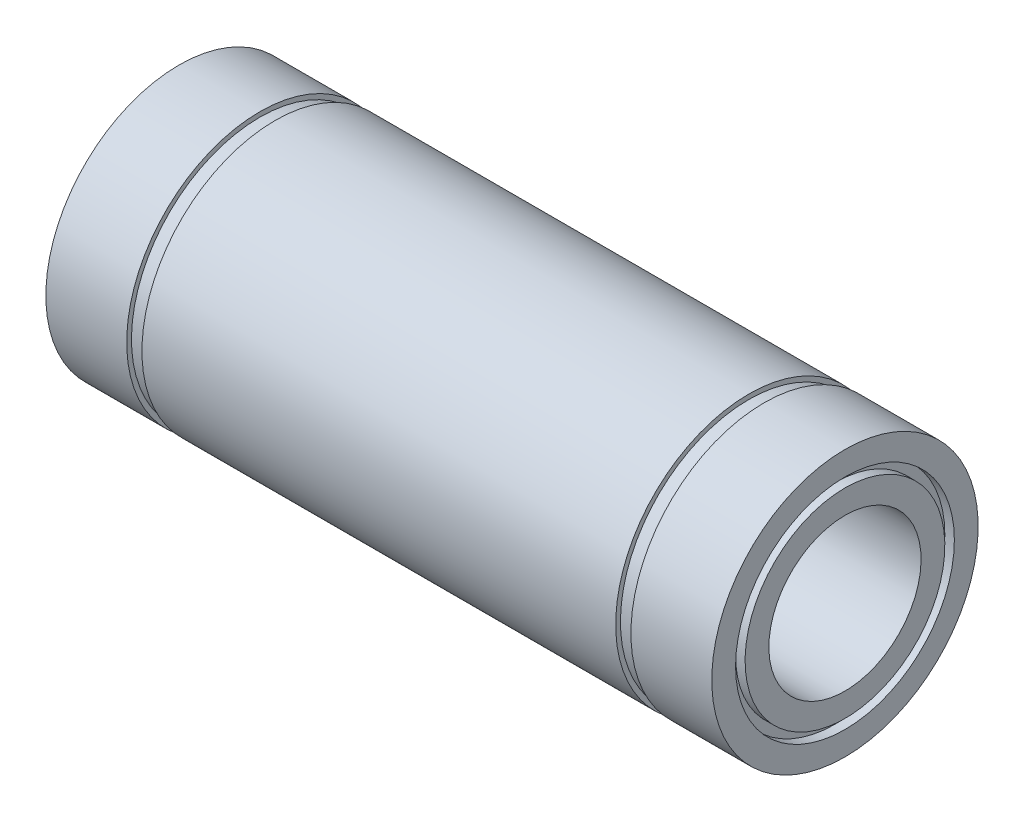
ISO-10303-21;
HEADER;
FILE_DESCRIPTION(('STEP AP214'),'2;1');
FILE_NAME('part.step','',(''),(''),'','','');
FILE_SCHEMA(('AUTOMOTIVE_DESIGN { 1 0 10303 214 1 1 1 1 }'));
ENDSEC;
DATA;
#1=APPLICATION_CONTEXT('core data for automotive mechanical design processes');
#2=APPLICATION_PROTOCOL_DEFINITION('international standard','automotive_design',2000,#1);
#3=PRODUCT_CONTEXT('',#1,'mechanical');
#4=PRODUCT('Part','Part','',(#3));
#5=PRODUCT_RELATED_PRODUCT_CATEGORY('part','',(#4));
#6=PRODUCT_DEFINITION_FORMATION('','',#4);
#7=PRODUCT_DEFINITION_CONTEXT('part definition',#1,'design');
#8=PRODUCT_DEFINITION('design','',#6,#7);
#9=PRODUCT_DEFINITION_SHAPE('','',#8);
#10=(LENGTH_UNIT() NAMED_UNIT(*) SI_UNIT(.MILLI.,.METRE.));
#11=(NAMED_UNIT(*) PLANE_ANGLE_UNIT() SI_UNIT($,.RADIAN.));
#12=(NAMED_UNIT(*) SI_UNIT($,.STERADIAN.) SOLID_ANGLE_UNIT());
#13=UNCERTAINTY_MEASURE_WITH_UNIT(LENGTH_MEASURE(1.E-05),#10,'distance_accuracy_value','');
#14=(GEOMETRIC_REPRESENTATION_CONTEXT(3) GLOBAL_UNCERTAINTY_ASSIGNED_CONTEXT((#13)) GLOBAL_UNIT_ASSIGNED_CONTEXT((#10,
#11,#12)) REPRESENTATION_CONTEXT('',''));
#15=CARTESIAN_POINT('',(0.,0.,0.));
#16=DIRECTION('',(0.,0.,1.));
#17=DIRECTION('',(1.,0.,0.));
#18=AXIS2_PLACEMENT_3D('',#15,#16,#17);
#19=CARTESIAN_POINT('',(-35.,11.5,0.));
#20=DIRECTION('',(-1.,0.,0.));
#21=DIRECTION('',(0.,-1.,0.));
#22=AXIS2_PLACEMENT_3D('',#19,#20,#21);
#23=PLANE('',#22);
#24=CARTESIAN_POINT('',(-35.,0.,0.));
#25=DIRECTION('',(1.,0.,0.));
#26=DIRECTION('',(0.,1.,0.));
#27=AXIS2_PLACEMENT_3D('',#24,#25,#26);
#28=CIRCLE('',#27,11.5);
#29=CARTESIAN_POINT('',(-35.,11.5,0.));
#30=VERTEX_POINT('',#29);
#31=EDGE_CURVE('E123',#30,#30,#28,.T.);
#32=ORIENTED_EDGE('',*,*,#31,.T.);
#33=EDGE_LOOP('',(#32));
#34=FACE_BOUND('',#33,.T.);
#35=CARTESIAN_POINT('',(-35.,0.,0.));
#36=DIRECTION('',(1.,0.,0.));
#37=DIRECTION('',(0.,1.,0.));
#38=AXIS2_PLACEMENT_3D('',#35,#36,#37);
#39=CIRCLE('',#38,14.);
#40=CARTESIAN_POINT('',(-35.,14.,0.));
#41=VERTEX_POINT('',#40);
#42=EDGE_CURVE('E10',#41,#41,#39,.T.);
#43=ORIENTED_EDGE('',*,*,#42,.F.);
#44=EDGE_LOOP('',(#43));
#45=FACE_BOUND('',#44,.T.);
#46=ADVANCED_FACE('F40',(#34,#45),#23,.T.);
#47=CARTESIAN_POINT('',(0.,0.,0.));
#48=DIRECTION('',(1.,0.,0.));
#49=DIRECTION('',(0.,1.,0.));
#50=AXIS2_PLACEMENT_3D('',#47,#48,#49);
#51=CYLINDRICAL_SURFACE('',#50,14.);
#52=ORIENTED_EDGE('',*,*,#42,.T.);
#53=EDGE_LOOP('',(#52));
#54=FACE_BOUND('',#53,.T.);
#55=CARTESIAN_POINT('',(-26.5,0.,0.));
#56=DIRECTION('',(1.,0.,0.));
#57=DIRECTION('',(0.,1.,0.));
#58=AXIS2_PLACEMENT_3D('',#55,#56,#57);
#59=CIRCLE('',#58,14.);
#60=CARTESIAN_POINT('',(-26.5,14.,0.));
#61=VERTEX_POINT('',#60);
#62=EDGE_CURVE('E47',#61,#61,#59,.T.);
#63=ORIENTED_EDGE('',*,*,#62,.F.);
#64=EDGE_LOOP('',(#63));
#65=FACE_BOUND('',#64,.T.);
#66=ADVANCED_FACE('F142',(#54,#65),#51,.T.);
#67=CARTESIAN_POINT('',(-26.5,14.,0.));
#68=DIRECTION('',(1.,0.,0.));
#69=DIRECTION('',(0.,1.,0.));
#70=AXIS2_PLACEMENT_3D('',#67,#68,#69);
#71=PLANE('',#70);
#72=ORIENTED_EDGE('',*,*,#62,.T.);
#73=EDGE_LOOP('',(#72));
#74=FACE_BOUND('',#73,.T.);
#75=CARTESIAN_POINT('',(-26.5,0.,0.));
#76=DIRECTION('',(1.,0.,0.));
#77=DIRECTION('',(0.,1.,0.));
#78=AXIS2_PLACEMENT_3D('',#75,#76,#77);
#79=CIRCLE('',#78,13.5);
#80=CARTESIAN_POINT('',(-26.5,13.5,0.));
#81=VERTEX_POINT('',#80);
#82=EDGE_CURVE('E54',#81,#81,#79,.T.);
#83=ORIENTED_EDGE('',*,*,#82,.F.);
#84=EDGE_LOOP('',(#83));
#85=FACE_BOUND('',#84,.T.);
#86=ADVANCED_FACE('F146',(#74,#85),#71,.T.);
#87=CARTESIAN_POINT('',(0.,0.,0.));
#88=DIRECTION('',(1.,0.,0.));
#89=DIRECTION('',(0.,1.,0.));
#90=AXIS2_PLACEMENT_3D('',#87,#88,#89);
#91=CYLINDRICAL_SURFACE('',#90,13.5);
#92=ORIENTED_EDGE('',*,*,#82,.T.);
#93=EDGE_LOOP('',(#92));
#94=FACE_BOUND('',#93,.T.);
#95=CARTESIAN_POINT('',(-24.9,0.,0.));
#96=DIRECTION('',(1.,0.,0.));
#97=DIRECTION('',(0.,1.,0.));
#98=AXIS2_PLACEMENT_3D('',#95,#96,#97);
#99=CIRCLE('',#98,13.5);
#100=CARTESIAN_POINT('',(-24.9,13.5,0.));
#101=VERTEX_POINT('',#100);
#102=EDGE_CURVE('E61',#101,#101,#99,.T.);
#103=ORIENTED_EDGE('',*,*,#102,.F.);
#104=EDGE_LOOP('',(#103));
#105=FACE_BOUND('',#104,.T.);
#106=ADVANCED_FACE('F150',(#94,#105),#91,.T.);
#107=CARTESIAN_POINT('',(-24.9,13.5,0.));
#108=DIRECTION('',(-1.,0.,0.));
#109=DIRECTION('',(0.,-1.,0.));
#110=AXIS2_PLACEMENT_3D('',#107,#108,#109);
#111=PLANE('',#110);
#112=ORIENTED_EDGE('',*,*,#102,.T.);
#113=EDGE_LOOP('',(#112));
#114=FACE_BOUND('',#113,.T.);
#115=CARTESIAN_POINT('',(-24.9,0.,0.));
#116=DIRECTION('',(1.,0.,0.));
#117=DIRECTION('',(0.,1.,0.));
#118=AXIS2_PLACEMENT_3D('',#115,#116,#117);
#119=CIRCLE('',#118,14.);
#120=CARTESIAN_POINT('',(-24.9,14.,0.));
#121=VERTEX_POINT('',#120);
#122=EDGE_CURVE('E66',#121,#121,#119,.T.);
#123=ORIENTED_EDGE('',*,*,#122,.F.);
#124=EDGE_LOOP('',(#123));
#125=FACE_BOUND('',#124,.T.);
#126=ADVANCED_FACE('F156',(#114,#125),#111,.T.);
#127=CARTESIAN_POINT('',(0.,0.,0.));
#128=DIRECTION('',(1.,0.,0.));
#129=DIRECTION('',(0.,1.,0.));
#130=AXIS2_PLACEMENT_3D('',#127,#128,#129);
#131=CYLINDRICAL_SURFACE('',#130,14.);
#132=ORIENTED_EDGE('',*,*,#122,.T.);
#133=EDGE_LOOP('',(#132));
#134=FACE_BOUND('',#133,.T.);
#135=CARTESIAN_POINT('',(24.9,0.,0.));
#136=DIRECTION('',(1.,0.,0.));
#137=DIRECTION('',(0.,1.,0.));
#138=AXIS2_PLACEMENT_3D('',#135,#136,#137);
#139=CIRCLE('',#138,14.);
#140=CARTESIAN_POINT('',(24.9,14.,0.));
#141=VERTEX_POINT('',#140);
#142=EDGE_CURVE('E70',#141,#141,#139,.T.);
#143=ORIENTED_EDGE('',*,*,#142,.F.);
#144=EDGE_LOOP('',(#143));
#145=FACE_BOUND('',#144,.T.);
#146=ADVANCED_FACE('F160',(#134,#145),#131,.T.);
#147=CARTESIAN_POINT('',(24.9,14.,0.));
#148=DIRECTION('',(1.,0.,0.));
#149=DIRECTION('',(0.,1.,0.));
#150=AXIS2_PLACEMENT_3D('',#147,#148,#149);
#151=PLANE('',#150);
#152=ORIENTED_EDGE('',*,*,#142,.T.);
#153=EDGE_LOOP('',(#152));
#154=FACE_BOUND('',#153,.T.);
#155=CARTESIAN_POINT('',(24.9,0.,0.));
#156=DIRECTION('',(1.,0.,0.));
#157=DIRECTION('',(0.,1.,0.));
#158=AXIS2_PLACEMENT_3D('',#155,#156,#157);
#159=CIRCLE('',#158,13.5);
#160=CARTESIAN_POINT('',(24.9,13.5,0.));
#161=VERTEX_POINT('',#160);
#162=EDGE_CURVE('E74',#161,#161,#159,.T.);
#163=ORIENTED_EDGE('',*,*,#162,.F.);
#164=EDGE_LOOP('',(#163));
#165=FACE_BOUND('',#164,.T.);
#166=ADVANCED_FACE('F164',(#154,#165),#151,.T.);
#167=CARTESIAN_POINT('',(0.,0.,0.));
#168=DIRECTION('',(1.,0.,0.));
#169=DIRECTION('',(0.,1.,0.));
#170=AXIS2_PLACEMENT_3D('',#167,#168,#169);
#171=CYLINDRICAL_SURFACE('',#170,13.5);
#172=ORIENTED_EDGE('',*,*,#162,.T.);
#173=EDGE_LOOP('',(#172));
#174=FACE_BOUND('',#173,.T.);
#175=CARTESIAN_POINT('',(26.5,0.,0.));
#176=DIRECTION('',(1.,0.,0.));
#177=DIRECTION('',(0.,1.,0.));
#178=AXIS2_PLACEMENT_3D('',#175,#176,#177);
#179=CIRCLE('',#178,13.5);
#180=CARTESIAN_POINT('',(26.5,13.5,0.));
#181=VERTEX_POINT('',#180);
#182=EDGE_CURVE('E78',#181,#181,#179,.T.);
#183=ORIENTED_EDGE('',*,*,#182,.F.);
#184=EDGE_LOOP('',(#183));
#185=FACE_BOUND('',#184,.T.);
#186=ADVANCED_FACE('F168',(#174,#185),#171,.T.);
#187=CARTESIAN_POINT('',(26.5,13.5,0.));
#188=DIRECTION('',(-1.,0.,0.));
#189=DIRECTION('',(0.,-1.,0.));
#190=AXIS2_PLACEMENT_3D('',#187,#188,#189);
#191=PLANE('',#190);
#192=ORIENTED_EDGE('',*,*,#182,.T.);
#193=EDGE_LOOP('',(#192));
#194=FACE_BOUND('',#193,.T.);
#195=CARTESIAN_POINT('',(26.5,0.,0.));
#196=DIRECTION('',(1.,0.,0.));
#197=DIRECTION('',(0.,1.,0.));
#198=AXIS2_PLACEMENT_3D('',#195,#196,#197);
#199=CIRCLE('',#198,14.);
#200=CARTESIAN_POINT('',(26.5,14.,0.));
#201=VERTEX_POINT('',#200);
#202=EDGE_CURVE('E82',#201,#201,#199,.T.);
#203=ORIENTED_EDGE('',*,*,#202,.F.);
#204=EDGE_LOOP('',(#203));
#205=FACE_BOUND('',#204,.T.);
#206=ADVANCED_FACE('F172',(#194,#205),#191,.T.);
#207=CARTESIAN_POINT('',(0.,0.,0.));
#208=DIRECTION('',(1.,0.,0.));
#209=DIRECTION('',(0.,1.,0.));
#210=AXIS2_PLACEMENT_3D('',#207,#208,#209);
#211=CYLINDRICAL_SURFACE('',#210,14.);
#212=ORIENTED_EDGE('',*,*,#202,.T.);
#213=EDGE_LOOP('',(#212));
#214=FACE_BOUND('',#213,.T.);
#215=CARTESIAN_POINT('',(35.,0.,0.));
#216=DIRECTION('',(1.,0.,0.));
#217=DIRECTION('',(0.,1.,0.));
#218=AXIS2_PLACEMENT_3D('',#215,#216,#217);
#219=CIRCLE('',#218,14.);
#220=CARTESIAN_POINT('',(35.,14.,0.));
#221=VERTEX_POINT('',#220);
#222=EDGE_CURVE('E86',#221,#221,#219,.T.);
#223=ORIENTED_EDGE('',*,*,#222,.F.);
#224=EDGE_LOOP('',(#223));
#225=FACE_BOUND('',#224,.T.);
#226=ADVANCED_FACE('F176',(#214,#225),#211,.T.);
#227=CARTESIAN_POINT('',(35.,14.,0.));
#228=DIRECTION('',(1.,0.,0.));
#229=DIRECTION('',(0.,1.,0.));
#230=AXIS2_PLACEMENT_3D('',#227,#228,#229);
#231=PLANE('',#230);
#232=ORIENTED_EDGE('',*,*,#222,.T.);
#233=EDGE_LOOP('',(#232));
#234=FACE_BOUND('',#233,.T.);
#235=CARTESIAN_POINT('',(35.,0.,0.));
#236=DIRECTION('',(1.,0.,0.));
#237=DIRECTION('',(0.,1.,0.));
#238=AXIS2_PLACEMENT_3D('',#235,#236,#237);
#239=CIRCLE('',#238,11.5);
#240=CARTESIAN_POINT('',(35.,11.5,0.));
#241=VERTEX_POINT('',#240);
#242=EDGE_CURVE('E90',#241,#241,#239,.T.);
#243=ORIENTED_EDGE('',*,*,#242,.F.);
#244=EDGE_LOOP('',(#243));
#245=FACE_BOUND('',#244,.T.);
#246=ADVANCED_FACE('F180',(#234,#245),#231,.T.);
#247=CARTESIAN_POINT('',(0.,0.,0.));
#248=DIRECTION('',(1.,0.,0.));
#249=DIRECTION('',(0.,1.,0.));
#250=AXIS2_PLACEMENT_3D('',#247,#248,#249);
#251=CYLINDRICAL_SURFACE('',#250,11.5);
#252=ORIENTED_EDGE('',*,*,#242,.T.);
#253=EDGE_LOOP('',(#252));
#254=FACE_BOUND('',#253,.T.);
#255=CARTESIAN_POINT('',(34.,0.,0.));
#256=DIRECTION('',(1.,0.,0.));
#257=DIRECTION('',(0.,1.,0.));
#258=AXIS2_PLACEMENT_3D('',#255,#256,#257);
#259=CIRCLE('',#258,11.5);
#260=CARTESIAN_POINT('',(34.,11.5,0.));
#261=VERTEX_POINT('',#260);
#262=EDGE_CURVE('E93',#261,#261,#259,.T.);
#263=ORIENTED_EDGE('',*,*,#262,.F.);
#264=EDGE_LOOP('',(#263));
#265=FACE_BOUND('',#264,.T.);
#266=ADVANCED_FACE('F184',(#254,#265),#251,.F.);
#267=CARTESIAN_POINT('',(34.,11.5,0.));
#268=DIRECTION('',(1.,0.,0.));
#269=DIRECTION('',(0.,1.,0.));
#270=AXIS2_PLACEMENT_3D('',#267,#268,#269);
#271=PLANE('',#270);
#272=ORIENTED_EDGE('',*,*,#262,.T.);
#273=EDGE_LOOP('',(#272));
#274=FACE_BOUND('',#273,.T.);
#275=CARTESIAN_POINT('',(34.,0.,0.));
#276=DIRECTION('',(1.,0.,0.));
#277=DIRECTION('',(0.,1.,0.));
#278=AXIS2_PLACEMENT_3D('',#275,#276,#277);
#279=CIRCLE('',#278,10.5);
#280=CARTESIAN_POINT('',(34.,10.5,0.));
#281=VERTEX_POINT('',#280);
#282=EDGE_CURVE('E97',#281,#281,#279,.T.);
#283=ORIENTED_EDGE('',*,*,#282,.F.);
#284=EDGE_LOOP('',(#283));
#285=FACE_BOUND('',#284,.T.);
#286=ADVANCED_FACE('F188',(#274,#285),#271,.T.);
#287=CARTESIAN_POINT('',(0.,0.,0.));
#288=DIRECTION('',(1.,0.,0.));
#289=DIRECTION('',(0.,1.,0.));
#290=AXIS2_PLACEMENT_3D('',#287,#288,#289);
#291=CYLINDRICAL_SURFACE('',#290,10.5);
#292=ORIENTED_EDGE('',*,*,#282,.T.);
#293=EDGE_LOOP('',(#292));
#294=FACE_BOUND('',#293,.T.);
#295=CARTESIAN_POINT('',(35.,0.,0.));
#296=DIRECTION('',(1.,0.,0.));
#297=DIRECTION('',(0.,1.,0.));
#298=AXIS2_PLACEMENT_3D('',#295,#296,#297);
#299=CIRCLE('',#298,10.5);
#300=CARTESIAN_POINT('',(35.,10.5,0.));
#301=VERTEX_POINT('',#300);
#302=EDGE_CURVE('E101',#301,#301,#299,.T.);
#303=ORIENTED_EDGE('',*,*,#302,.F.);
#304=EDGE_LOOP('',(#303));
#305=FACE_BOUND('',#304,.T.);
#306=ADVANCED_FACE('F192',(#294,#305),#291,.T.);
#307=CARTESIAN_POINT('',(35.,10.5,0.));
#308=DIRECTION('',(1.,0.,0.));
#309=DIRECTION('',(0.,1.,0.));
#310=AXIS2_PLACEMENT_3D('',#307,#308,#309);
#311=PLANE('',#310);
#312=ORIENTED_EDGE('',*,*,#302,.T.);
#313=EDGE_LOOP('',(#312));
#314=FACE_BOUND('',#313,.T.);
#315=CARTESIAN_POINT('',(35.,0.,0.));
#316=DIRECTION('',(1.,0.,0.));
#317=DIRECTION('',(0.,1.,0.));
#318=AXIS2_PLACEMENT_3D('',#315,#316,#317);
#319=CIRCLE('',#318,8.);
#320=CARTESIAN_POINT('',(35.,8.,0.));
#321=VERTEX_POINT('',#320);
#322=EDGE_CURVE('E104',#321,#321,#319,.T.);
#323=ORIENTED_EDGE('',*,*,#322,.F.);
#324=EDGE_LOOP('',(#323));
#325=FACE_BOUND('',#324,.T.);
#326=ADVANCED_FACE('F196',(#314,#325),#311,.T.);
#327=CARTESIAN_POINT('',(0.,0.,0.));
#328=DIRECTION('',(1.,0.,0.));
#329=DIRECTION('',(0.,1.,0.));
#330=AXIS2_PLACEMENT_3D('',#327,#328,#329);
#331=CYLINDRICAL_SURFACE('',#330,8.);
#332=ORIENTED_EDGE('',*,*,#322,.T.);
#333=EDGE_LOOP('',(#332));
#334=FACE_BOUND('',#333,.T.);
#335=CARTESIAN_POINT('',(-35.,0.,0.));
#336=DIRECTION('',(1.,0.,0.));
#337=DIRECTION('',(0.,1.,0.));
#338=AXIS2_PLACEMENT_3D('',#335,#336,#337);
#339=CIRCLE('',#338,8.);
#340=CARTESIAN_POINT('',(-35.,8.,0.));
#341=VERTEX_POINT('',#340);
#342=EDGE_CURVE('E108',#341,#341,#339,.T.);
#343=ORIENTED_EDGE('',*,*,#342,.F.);
#344=EDGE_LOOP('',(#343));
#345=FACE_BOUND('',#344,.T.);
#346=ADVANCED_FACE('F200',(#334,#345),#331,.F.);
#347=CARTESIAN_POINT('',(-35.,8.,0.));
#348=DIRECTION('',(-1.,0.,0.));
#349=DIRECTION('',(0.,-1.,0.));
#350=AXIS2_PLACEMENT_3D('',#347,#348,#349);
#351=PLANE('',#350);
#352=ORIENTED_EDGE('',*,*,#342,.T.);
#353=EDGE_LOOP('',(#352));
#354=FACE_BOUND('',#353,.T.);
#355=CARTESIAN_POINT('',(-35.,0.,0.));
#356=DIRECTION('',(1.,0.,0.));
#357=DIRECTION('',(0.,1.,0.));
#358=AXIS2_PLACEMENT_3D('',#355,#356,#357);
#359=CIRCLE('',#358,10.5);
#360=CARTESIAN_POINT('',(-35.,10.5,0.));
#361=VERTEX_POINT('',#360);
#362=EDGE_CURVE('E111',#361,#361,#359,.T.);
#363=ORIENTED_EDGE('',*,*,#362,.F.);
#364=EDGE_LOOP('',(#363));
#365=FACE_BOUND('',#364,.T.);
#366=ADVANCED_FACE('F204',(#354,#365),#351,.T.);
#367=CARTESIAN_POINT('',(0.,0.,0.));
#368=DIRECTION('',(1.,0.,0.));
#369=DIRECTION('',(0.,1.,0.));
#370=AXIS2_PLACEMENT_3D('',#367,#368,#369);
#371=CYLINDRICAL_SURFACE('',#370,10.5);
#372=ORIENTED_EDGE('',*,*,#362,.T.);
#373=EDGE_LOOP('',(#372));
#374=FACE_BOUND('',#373,.T.);
#375=CARTESIAN_POINT('',(-34.,0.,0.));
#376=DIRECTION('',(1.,0.,0.));
#377=DIRECTION('',(0.,1.,0.));
#378=AXIS2_PLACEMENT_3D('',#375,#376,#377);
#379=CIRCLE('',#378,10.5);
#380=CARTESIAN_POINT('',(-34.,10.5,0.));
#381=VERTEX_POINT('',#380);
#382=EDGE_CURVE('E115',#381,#381,#379,.T.);
#383=ORIENTED_EDGE('',*,*,#382,.F.);
#384=EDGE_LOOP('',(#383));
#385=FACE_BOUND('',#384,.T.);
#386=ADVANCED_FACE('F138',(#374,#385),#371,.T.);
#387=CARTESIAN_POINT('',(-34.,11.5,0.));
#388=DIRECTION('',(-1.,0.,0.));
#389=DIRECTION('',(0.,-1.,0.));
#390=AXIS2_PLACEMENT_3D('',#387,#388,#389);
#391=PLANE('',#390);
#392=ORIENTED_EDGE('',*,*,#382,.T.);
#393=EDGE_LOOP('',(#392));
#394=FACE_BOUND('',#393,.T.);
#395=CARTESIAN_POINT('',(-34.,0.,0.));
#396=DIRECTION('',(1.,0.,0.));
#397=DIRECTION('',(0.,1.,0.));
#398=AXIS2_PLACEMENT_3D('',#395,#396,#397);
#399=CIRCLE('',#398,11.5);
#400=CARTESIAN_POINT('',(-34.,11.5,0.));
#401=VERTEX_POINT('',#400);
#402=EDGE_CURVE('E119',#401,#401,#399,.T.);
#403=ORIENTED_EDGE('',*,*,#402,.F.);
#404=EDGE_LOOP('',(#403));
#405=FACE_BOUND('',#404,.T.);
#406=ADVANCED_FACE('F132',(#394,#405),#391,.T.);
#407=CARTESIAN_POINT('',(0.,0.,0.));
#408=DIRECTION('',(1.,0.,0.));
#409=DIRECTION('',(0.,1.,0.));
#410=AXIS2_PLACEMENT_3D('',#407,#408,#409);
#411=CYLINDRICAL_SURFACE('',#410,11.5);
#412=ORIENTED_EDGE('',*,*,#402,.T.);
#413=EDGE_LOOP('',(#412));
#414=FACE_BOUND('',#413,.T.);
#415=ORIENTED_EDGE('',*,*,#31,.F.);
#416=EDGE_LOOP('',(#415));
#417=FACE_BOUND('',#416,.T.);
#418=ADVANCED_FACE('F130',(#414,#417),#411,.F.);
#419=CLOSED_SHELL('',(#46,#66,#86,#106,#126,#146,#166,#186,#206,#226,#246,#266,#286,#306,#326,
#346,#366,#386,#406,#418));
#420=MANIFOLD_SOLID_BREP('B2',#419);
#421=ADVANCED_BREP_SHAPE_REPRESENTATION('',(#18,#420),#14);
#422=SHAPE_DEFINITION_REPRESENTATION(#9,#421);
ENDSEC;
END-ISO-10303-21;
